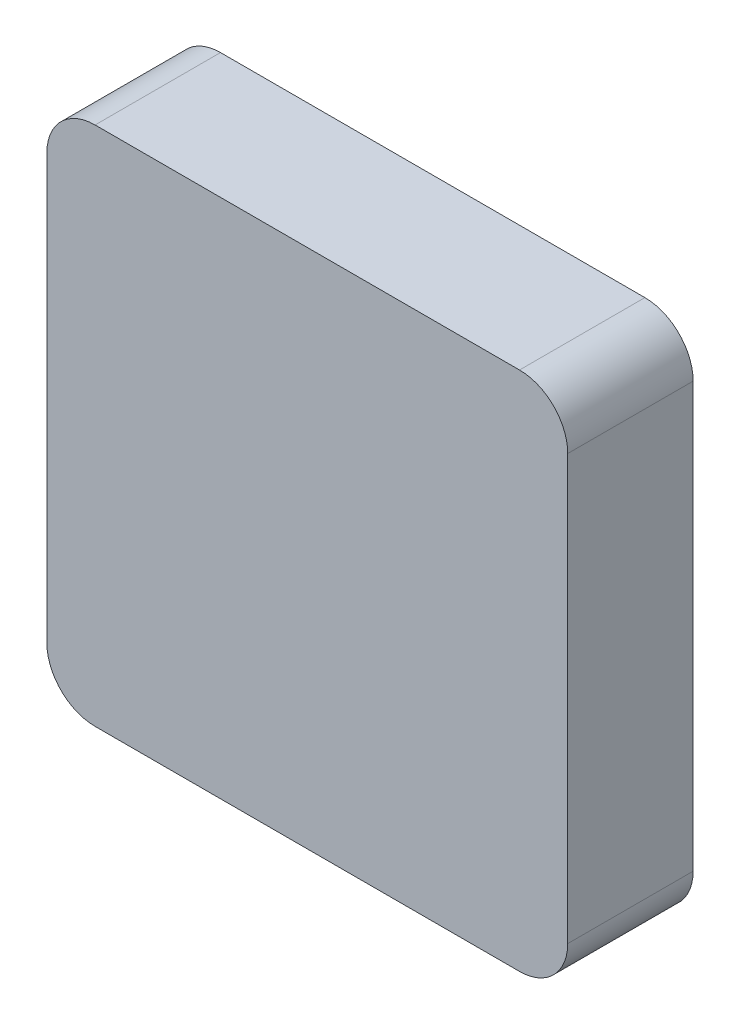
ISO-10303-21;
HEADER;
FILE_DESCRIPTION(('STEP AP214'),'2;1');
FILE_NAME('part.step','',(''),(''),'','','');
FILE_SCHEMA(('AUTOMOTIVE_DESIGN { 1 0 10303 214 1 1 1 1 }'));
ENDSEC;
DATA;
#1=APPLICATION_CONTEXT('core data for automotive mechanical design processes');
#2=APPLICATION_PROTOCOL_DEFINITION('international standard','automotive_design',2000,#1);
#3=PRODUCT_CONTEXT('',#1,'mechanical');
#4=PRODUCT('Part','Part','',(#3));
#5=PRODUCT_RELATED_PRODUCT_CATEGORY('part','',(#4));
#6=PRODUCT_DEFINITION_FORMATION('','',#4);
#7=PRODUCT_DEFINITION_CONTEXT('part definition',#1,'design');
#8=PRODUCT_DEFINITION('design','',#6,#7);
#9=PRODUCT_DEFINITION_SHAPE('','',#8);
#10=(LENGTH_UNIT() NAMED_UNIT(*) SI_UNIT(.MILLI.,.METRE.));
#11=(NAMED_UNIT(*) PLANE_ANGLE_UNIT() SI_UNIT($,.RADIAN.));
#12=(NAMED_UNIT(*) SI_UNIT($,.STERADIAN.) SOLID_ANGLE_UNIT());
#13=UNCERTAINTY_MEASURE_WITH_UNIT(LENGTH_MEASURE(1.E-05),#10,'distance_accuracy_value','');
#14=(GEOMETRIC_REPRESENTATION_CONTEXT(3) GLOBAL_UNCERTAINTY_ASSIGNED_CONTEXT((#13)) GLOBAL_UNIT_ASSIGNED_CONTEXT((#10,
#11,#12)) REPRESENTATION_CONTEXT('',''));
#15=CARTESIAN_POINT('',(0.,0.,0.));
#16=DIRECTION('',(0.,0.,1.));
#17=DIRECTION('',(1.,0.,0.));
#18=AXIS2_PLACEMENT_3D('',#15,#16,#17);
#19=CARTESIAN_POINT('',(0.,-54.,13.));
#20=DIRECTION('',(1.,0.,0.));
#21=DIRECTION('',(0.,1.,0.));
#22=AXIS2_PLACEMENT_3D('',#19,#20,#21);
#23=PLANE('',#22);
#24=DIRECTION('',(0.,-1.,0.));
#25=VECTOR('',#24,1.);
#26=CARTESIAN_POINT('',(0.,-54.,13.));
#27=LINE('',#26,#25);
#28=CARTESIAN_POINT('',(0.,-5.,13.));
#29=VERTEX_POINT('',#28);
#30=CARTESIAN_POINT('',(0.,-49.,13.));
#31=VERTEX_POINT('',#30);
#32=EDGE_CURVE('E118',#29,#31,#27,.T.);
#33=ORIENTED_EDGE('',*,*,#32,.F.);
#34=DIRECTION('',(0.,0.,-1.));
#35=VECTOR('',#34,1.);
#36=CARTESIAN_POINT('',(0.,-5.,13.));
#37=LINE('',#36,#35);
#38=CARTESIAN_POINT('',(0.,-5.,0.));
#39=VERTEX_POINT('',#38);
#40=EDGE_CURVE('E103',#29,#39,#37,.T.);
#41=ORIENTED_EDGE('',*,*,#40,.T.);
#42=DIRECTION('',(0.,-1.,0.));
#43=VECTOR('',#42,1.);
#44=CARTESIAN_POINT('',(0.,-54.,0.));
#45=LINE('',#44,#43);
#46=CARTESIAN_POINT('',(0.,-49.,0.));
#47=VERTEX_POINT('',#46);
#48=EDGE_CURVE('E115',#39,#47,#45,.T.);
#49=ORIENTED_EDGE('',*,*,#48,.T.);
#50=DIRECTION('',(0.,0.,-1.));
#51=VECTOR('',#50,1.);
#52=CARTESIAN_POINT('',(0.,-49.,13.));
#53=LINE('',#52,#51);
#54=EDGE_CURVE('E120',#47,#31,#53,.F.);
#55=ORIENTED_EDGE('',*,*,#54,.T.);
#56=EDGE_LOOP('',(#33,#41,#49,#55));
#57=FACE_BOUND('',#56,.T.);
#58=ADVANCED_FACE('F33',(#57),#23,.F.);
#59=CARTESIAN_POINT('',(54.,-54.,13.));
#60=DIRECTION('',(0.,1.,0.));
#61=DIRECTION('',(-1.,0.,0.));
#62=AXIS2_PLACEMENT_3D('',#59,#60,#61);
#63=PLANE('',#62);
#64=DIRECTION('',(1.,0.,0.));
#65=VECTOR('',#64,1.);
#66=CARTESIAN_POINT('',(54.,-54.,13.));
#67=LINE('',#66,#65);
#68=CARTESIAN_POINT('',(5.,-54.,13.));
#69=VERTEX_POINT('',#68);
#70=CARTESIAN_POINT('',(49.,-54.,13.));
#71=VERTEX_POINT('',#70);
#72=EDGE_CURVE('E160',#69,#71,#67,.T.);
#73=ORIENTED_EDGE('',*,*,#72,.F.);
#74=DIRECTION('',(0.,0.,-1.));
#75=VECTOR('',#74,1.);
#76=CARTESIAN_POINT('',(5.,-54.,13.));
#77=LINE('',#76,#75);
#78=CARTESIAN_POINT('',(5.,-54.,0.));
#79=VERTEX_POINT('',#78);
#80=EDGE_CURVE('E153',#69,#79,#77,.T.);
#81=ORIENTED_EDGE('',*,*,#80,.T.);
#82=DIRECTION('',(1.,0.,0.));
#83=VECTOR('',#82,1.);
#84=CARTESIAN_POINT('',(54.,-54.,0.));
#85=LINE('',#84,#83);
#86=CARTESIAN_POINT('',(49.,-54.,0.));
#87=VERTEX_POINT('',#86);
#88=EDGE_CURVE('E124',#79,#87,#85,.T.);
#89=ORIENTED_EDGE('',*,*,#88,.T.);
#90=DIRECTION('',(0.,0.,-1.));
#91=VECTOR('',#90,1.);
#92=CARTESIAN_POINT('',(49.,-54.,13.));
#93=LINE('',#92,#91);
#94=EDGE_CURVE('E151',#87,#71,#93,.F.);
#95=ORIENTED_EDGE('',*,*,#94,.T.);
#96=EDGE_LOOP('',(#73,#81,#89,#95));
#97=FACE_BOUND('',#96,.T.);
#98=ADVANCED_FACE('F158',(#97),#63,.F.);
#99=CARTESIAN_POINT('',(54.,0.,13.));
#100=DIRECTION('',(-1.,0.,0.));
#101=DIRECTION('',(0.,-1.,0.));
#102=AXIS2_PLACEMENT_3D('',#99,#100,#101);
#103=PLANE('',#102);
#104=DIRECTION('',(0.,1.,0.));
#105=VECTOR('',#104,1.);
#106=CARTESIAN_POINT('',(54.,0.,13.));
#107=LINE('',#106,#105);
#108=CARTESIAN_POINT('',(54.,-49.,13.));
#109=VERTEX_POINT('',#108);
#110=CARTESIAN_POINT('',(54.,-5.,13.));
#111=VERTEX_POINT('',#110);
#112=EDGE_CURVE('E168',#109,#111,#107,.T.);
#113=ORIENTED_EDGE('',*,*,#112,.F.);
#114=DIRECTION('',(0.,0.,-1.));
#115=VECTOR('',#114,1.);
#116=CARTESIAN_POINT('',(54.,-49.,13.));
#117=LINE('',#116,#115);
#118=CARTESIAN_POINT('',(54.,-49.,0.));
#119=VERTEX_POINT('',#118);
#120=EDGE_CURVE('E11',#109,#119,#117,.T.);
#121=ORIENTED_EDGE('',*,*,#120,.T.);
#122=DIRECTION('',(0.,1.,0.));
#123=VECTOR('',#122,1.);
#124=CARTESIAN_POINT('',(54.,0.,0.));
#125=LINE('',#124,#123);
#126=CARTESIAN_POINT('',(54.,-5.,0.));
#127=VERTEX_POINT('',#126);
#128=EDGE_CURVE('E127',#119,#127,#125,.T.);
#129=ORIENTED_EDGE('',*,*,#128,.T.);
#130=DIRECTION('',(0.,0.,-1.));
#131=VECTOR('',#130,1.);
#132=CARTESIAN_POINT('',(54.,-5.,13.));
#133=LINE('',#132,#131);
#134=EDGE_CURVE('E41',#127,#111,#133,.F.);
#135=ORIENTED_EDGE('',*,*,#134,.T.);
#136=EDGE_LOOP('',(#113,#121,#129,#135));
#137=FACE_BOUND('',#136,.T.);
#138=ADVANCED_FACE('F167',(#137),#103,.F.);
#139=CARTESIAN_POINT('',(0.,0.,13.));
#140=DIRECTION('',(0.,-1.,0.));
#141=DIRECTION('',(0.,0.,-1.));
#142=AXIS2_PLACEMENT_3D('',#139,#140,#141);
#143=PLANE('',#142);
#144=DIRECTION('',(-1.,0.,0.));
#145=VECTOR('',#144,1.);
#146=CARTESIAN_POINT('',(0.,0.,0.));
#147=LINE('',#146,#145);
#148=CARTESIAN_POINT('',(49.,0.,0.));
#149=VERTEX_POINT('',#148);
#150=CARTESIAN_POINT('',(5.,0.,0.));
#151=VERTEX_POINT('',#150);
#152=EDGE_CURVE('E134',#149,#151,#147,.T.);
#153=ORIENTED_EDGE('',*,*,#152,.T.);
#154=DIRECTION('',(0.,0.,-1.));
#155=VECTOR('',#154,1.);
#156=CARTESIAN_POINT('',(5.,0.,13.));
#157=LINE('',#156,#155);
#158=CARTESIAN_POINT('',(5.,0.,13.));
#159=VERTEX_POINT('',#158);
#160=EDGE_CURVE('E104',#151,#159,#157,.F.);
#161=ORIENTED_EDGE('',*,*,#160,.T.);
#162=DIRECTION('',(-1.,0.,0.));
#163=VECTOR('',#162,1.);
#164=CARTESIAN_POINT('',(0.,0.,13.));
#165=LINE('',#164,#163);
#166=CARTESIAN_POINT('',(49.,0.,13.));
#167=VERTEX_POINT('',#166);
#168=EDGE_CURVE('E130',#167,#159,#165,.T.);
#169=ORIENTED_EDGE('',*,*,#168,.F.);
#170=DIRECTION('',(0.,0.,-1.));
#171=VECTOR('',#170,1.);
#172=CARTESIAN_POINT('',(49.,0.,13.));
#173=LINE('',#172,#171);
#174=EDGE_CURVE('E109',#167,#149,#173,.T.);
#175=ORIENTED_EDGE('',*,*,#174,.T.);
#176=EDGE_LOOP('',(#153,#161,#169,#175));
#177=FACE_BOUND('',#176,.T.);
#178=ADVANCED_FACE('F191',(#177),#143,.F.);
#179=CARTESIAN_POINT('',(0.,0.,13.));
#180=DIRECTION('',(0.,0.,-1.));
#181=DIRECTION('',(-1.,0.,0.));
#182=AXIS2_PLACEMENT_3D('',#179,#180,#181);
#183=PLANE('',#182);
#184=ORIENTED_EDGE('',*,*,#168,.T.);
#185=CARTESIAN_POINT('',(5.,-5.,13.));
#186=DIRECTION('',(0.,0.,-1.));
#187=DIRECTION('',(-1.,0.,0.));
#188=AXIS2_PLACEMENT_3D('',#185,#186,#187);
#189=CIRCLE('',#188,5.);
#190=EDGE_CURVE('E149',#159,#29,#189,.F.);
#191=ORIENTED_EDGE('',*,*,#190,.T.);
#192=ORIENTED_EDGE('',*,*,#32,.T.);
#193=CARTESIAN_POINT('',(5.,-49.,13.));
#194=DIRECTION('',(0.,0.,-1.));
#195=DIRECTION('',(-1.,0.,0.));
#196=AXIS2_PLACEMENT_3D('',#193,#194,#195);
#197=CIRCLE('',#196,5.);
#198=EDGE_CURVE('E147',#31,#69,#197,.F.);
#199=ORIENTED_EDGE('',*,*,#198,.T.);
#200=ORIENTED_EDGE('',*,*,#72,.T.);
#201=CARTESIAN_POINT('',(49.,-49.,13.));
#202=DIRECTION('',(0.,0.,-1.));
#203=DIRECTION('',(-1.,0.,0.));
#204=AXIS2_PLACEMENT_3D('',#201,#202,#203);
#205=CIRCLE('',#204,5.);
#206=EDGE_CURVE('E54',#71,#109,#205,.F.);
#207=ORIENTED_EDGE('',*,*,#206,.T.);
#208=ORIENTED_EDGE('',*,*,#112,.T.);
#209=CARTESIAN_POINT('',(49.,-5.,13.));
#210=DIRECTION('',(0.,0.,-1.));
#211=DIRECTION('',(-1.,0.,0.));
#212=AXIS2_PLACEMENT_3D('',#209,#210,#211);
#213=CIRCLE('',#212,5.);
#214=EDGE_CURVE('E144',#111,#167,#213,.F.);
#215=ORIENTED_EDGE('',*,*,#214,.T.);
#216=EDGE_LOOP('',(#184,#191,#192,#199,#200,#207,#208,#215));
#217=FACE_BOUND('',#216,.T.);
#218=ADVANCED_FACE('F173',(#217),#183,.F.);
#219=CARTESIAN_POINT('',(0.,0.,0.));
#220=DIRECTION('',(0.,0.,-1.));
#221=DIRECTION('',(-1.,0.,0.));
#222=AXIS2_PLACEMENT_3D('',#219,#220,#221);
#223=PLANE('',#222);
#224=ORIENTED_EDGE('',*,*,#48,.F.);
#225=CARTESIAN_POINT('',(5.,-5.,0.));
#226=DIRECTION('',(0.,0.,-1.));
#227=DIRECTION('',(-1.,0.,0.));
#228=AXIS2_PLACEMENT_3D('',#225,#226,#227);
#229=CIRCLE('',#228,5.);
#230=EDGE_CURVE('E99',#39,#151,#229,.T.);
#231=ORIENTED_EDGE('',*,*,#230,.T.);
#232=ORIENTED_EDGE('',*,*,#152,.F.);
#233=CARTESIAN_POINT('',(49.,-5.,0.));
#234=DIRECTION('',(0.,0.,-1.));
#235=DIRECTION('',(-1.,0.,0.));
#236=AXIS2_PLACEMENT_3D('',#233,#234,#235);
#237=CIRCLE('',#236,5.);
#238=EDGE_CURVE('E119',#149,#127,#237,.T.);
#239=ORIENTED_EDGE('',*,*,#238,.T.);
#240=ORIENTED_EDGE('',*,*,#128,.F.);
#241=CARTESIAN_POINT('',(49.,-49.,0.));
#242=DIRECTION('',(0.,0.,-1.));
#243=DIRECTION('',(-1.,0.,0.));
#244=AXIS2_PLACEMENT_3D('',#241,#242,#243);
#245=CIRCLE('',#244,5.);
#246=EDGE_CURVE('E138',#119,#87,#245,.T.);
#247=ORIENTED_EDGE('',*,*,#246,.T.);
#248=ORIENTED_EDGE('',*,*,#88,.F.);
#249=CARTESIAN_POINT('',(5.,-49.,0.));
#250=DIRECTION('',(0.,0.,-1.));
#251=DIRECTION('',(-1.,0.,0.));
#252=AXIS2_PLACEMENT_3D('',#249,#250,#251);
#253=CIRCLE('',#252,5.);
#254=EDGE_CURVE('E110',#79,#47,#253,.T.);
#255=ORIENTED_EDGE('',*,*,#254,.T.);
#256=EDGE_LOOP('',(#224,#231,#232,#239,#240,#247,#248,#255));
#257=FACE_BOUND('',#256,.T.);
#258=ADVANCED_FACE('F122',(#257),#223,.T.);
#259=CARTESIAN_POINT('',(5.,-5.,13.));
#260=DIRECTION('',(0.,0.,-1.));
#261=DIRECTION('',(-1.,0.,0.));
#262=AXIS2_PLACEMENT_3D('',#259,#260,#261);
#263=CYLINDRICAL_SURFACE('',#262,5.);
#264=ORIENTED_EDGE('',*,*,#190,.F.);
#265=ORIENTED_EDGE('',*,*,#160,.F.);
#266=ORIENTED_EDGE('',*,*,#230,.F.);
#267=ORIENTED_EDGE('',*,*,#40,.F.);
#268=EDGE_LOOP('',(#264,#265,#266,#267));
#269=FACE_BOUND('',#268,.T.);
#270=ADVANCED_FACE('F102',(#269),#263,.T.);
#271=CARTESIAN_POINT('',(5.,-49.,13.));
#272=DIRECTION('',(0.,0.,-1.));
#273=DIRECTION('',(-1.,0.,0.));
#274=AXIS2_PLACEMENT_3D('',#271,#272,#273);
#275=CYLINDRICAL_SURFACE('',#274,5.);
#276=ORIENTED_EDGE('',*,*,#198,.F.);
#277=ORIENTED_EDGE('',*,*,#54,.F.);
#278=ORIENTED_EDGE('',*,*,#254,.F.);
#279=ORIENTED_EDGE('',*,*,#80,.F.);
#280=EDGE_LOOP('',(#276,#277,#278,#279));
#281=FACE_BOUND('',#280,.T.);
#282=ADVANCED_FACE('F174',(#281),#275,.T.);
#283=CARTESIAN_POINT('',(49.,-49.,13.));
#284=DIRECTION('',(0.,0.,-1.));
#285=DIRECTION('',(-1.,0.,0.));
#286=AXIS2_PLACEMENT_3D('',#283,#284,#285);
#287=CYLINDRICAL_SURFACE('',#286,5.);
#288=ORIENTED_EDGE('',*,*,#206,.F.);
#289=ORIENTED_EDGE('',*,*,#94,.F.);
#290=ORIENTED_EDGE('',*,*,#246,.F.);
#291=ORIENTED_EDGE('',*,*,#120,.F.);
#292=EDGE_LOOP('',(#288,#289,#290,#291));
#293=FACE_BOUND('',#292,.T.);
#294=ADVANCED_FACE('F166',(#293),#287,.T.);
#295=CARTESIAN_POINT('',(49.,-5.,13.));
#296=DIRECTION('',(0.,0.,-1.));
#297=DIRECTION('',(-1.,0.,0.));
#298=AXIS2_PLACEMENT_3D('',#295,#296,#297);
#299=CYLINDRICAL_SURFACE('',#298,5.);
#300=ORIENTED_EDGE('',*,*,#214,.F.);
#301=ORIENTED_EDGE('',*,*,#134,.F.);
#302=ORIENTED_EDGE('',*,*,#238,.F.);
#303=ORIENTED_EDGE('',*,*,#174,.F.);
#304=EDGE_LOOP('',(#300,#301,#302,#303));
#305=FACE_BOUND('',#304,.T.);
#306=ADVANCED_FACE('F35',(#305),#299,.T.);
#307=CLOSED_SHELL('',(#58,#98,#138,#178,#218,#258,#270,#282,#294,#306));
#308=MANIFOLD_SOLID_BREP('B2',#307);
#309=ADVANCED_BREP_SHAPE_REPRESENTATION('',(#18,#308),#14);
#310=SHAPE_DEFINITION_REPRESENTATION(#9,#309);
ENDSEC;
END-ISO-10303-21;
